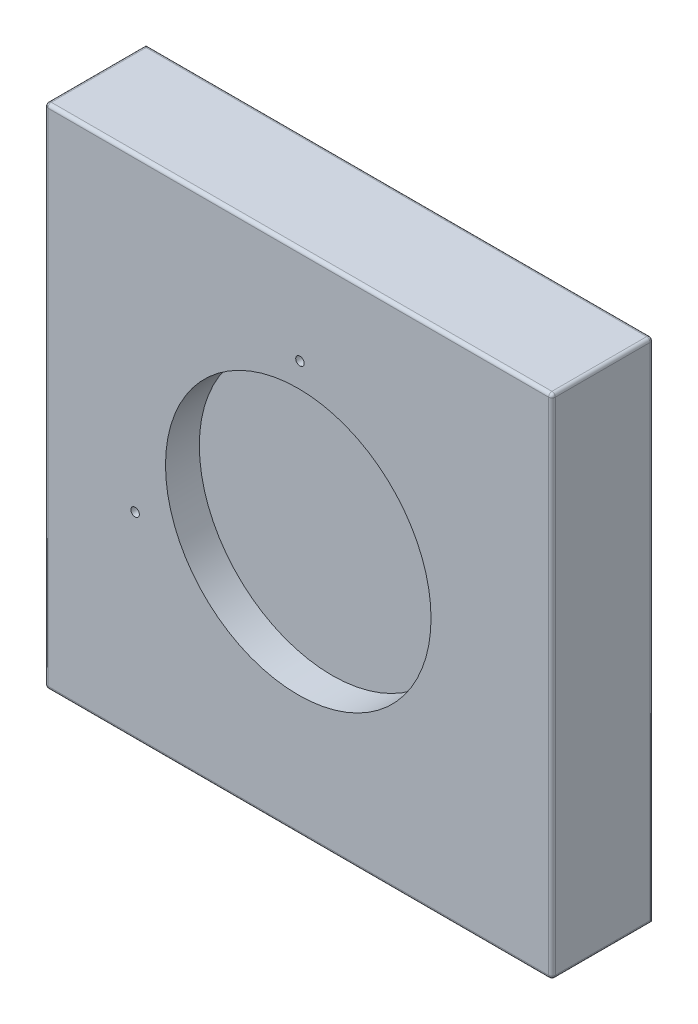
ISO-10303-21;
HEADER;
FILE_DESCRIPTION(('STEP AP214'),'2;1');
FILE_NAME('part.step','',(''),(''),'','','');
FILE_SCHEMA(('AUTOMOTIVE_DESIGN { 1 0 10303 214 1 1 1 1 }'));
ENDSEC;
DATA;
#1=APPLICATION_CONTEXT('core data for automotive mechanical design processes');
#2=APPLICATION_PROTOCOL_DEFINITION('international standard','automotive_design',2000,#1);
#3=PRODUCT_CONTEXT('',#1,'mechanical');
#4=PRODUCT('Part','Part','',(#3));
#5=PRODUCT_RELATED_PRODUCT_CATEGORY('part','',(#4));
#6=PRODUCT_DEFINITION_FORMATION('','',#4);
#7=PRODUCT_DEFINITION_CONTEXT('part definition',#1,'design');
#8=PRODUCT_DEFINITION('design','',#6,#7);
#9=PRODUCT_DEFINITION_SHAPE('','',#8);
#10=(LENGTH_UNIT() NAMED_UNIT(*) SI_UNIT(.MILLI.,.METRE.));
#11=(NAMED_UNIT(*) PLANE_ANGLE_UNIT() SI_UNIT($,.RADIAN.));
#12=(NAMED_UNIT(*) SI_UNIT($,.STERADIAN.) SOLID_ANGLE_UNIT());
#13=UNCERTAINTY_MEASURE_WITH_UNIT(LENGTH_MEASURE(1.E-05),#10,'distance_accuracy_value','');
#14=(GEOMETRIC_REPRESENTATION_CONTEXT(3) GLOBAL_UNCERTAINTY_ASSIGNED_CONTEXT((#13)) GLOBAL_UNIT_ASSIGNED_CONTEXT((#10,
#11,#12)) REPRESENTATION_CONTEXT('',''));
#15=CARTESIAN_POINT('',(0.,0.,0.));
#16=DIRECTION('',(0.,0.,1.));
#17=DIRECTION('',(1.,0.,0.));
#18=AXIS2_PLACEMENT_3D('',#15,#16,#17);
#19=CARTESIAN_POINT('',(-75.,-75.,-30.));
#20=DIRECTION('',(0.,-1.,0.));
#21=DIRECTION('',(0.,0.,-1.));
#22=AXIS2_PLACEMENT_3D('',#19,#20,#21);
#23=PLANE('',#22);
#24=DIRECTION('',(1.,0.,0.));
#25=VECTOR('',#24,1.);
#26=CARTESIAN_POINT('',(-75.,-75.,-30.));
#27=LINE('',#26,#25);
#28=CARTESIAN_POINT('',(-74.,-75.,-30.));
#29=VERTEX_POINT('',#28);
#30=CARTESIAN_POINT('',(74.,-75.,-30.));
#31=VERTEX_POINT('',#30);
#32=EDGE_CURVE('E153',#29,#31,#27,.T.);
#33=ORIENTED_EDGE('',*,*,#32,.T.);
#34=DIRECTION('',(0.,0.,1.));
#35=VECTOR('',#34,1.);
#36=CARTESIAN_POINT('',(74.,-75.,-30.));
#37=LINE('',#36,#35);
#38=CARTESIAN_POINT('',(74.,-75.,-1.));
#39=VERTEX_POINT('',#38);
#40=EDGE_CURVE('E163',#31,#39,#37,.T.);
#41=ORIENTED_EDGE('',*,*,#40,.T.);
#42=DIRECTION('',(1.,0.,0.));
#43=VECTOR('',#42,1.);
#44=CARTESIAN_POINT('',(-75.,-75.,-1.));
#45=LINE('',#44,#43);
#46=CARTESIAN_POINT('',(-74.,-75.,-1.));
#47=VERTEX_POINT('',#46);
#48=EDGE_CURVE('E159',#39,#47,#45,.F.);
#49=ORIENTED_EDGE('',*,*,#48,.T.);
#50=DIRECTION('',(0.,0.,1.));
#51=VECTOR('',#50,1.);
#52=CARTESIAN_POINT('',(-74.,-75.,-30.));
#53=LINE('',#52,#51);
#54=EDGE_CURVE('E161',#47,#29,#53,.F.);
#55=ORIENTED_EDGE('',*,*,#54,.T.);
#56=EDGE_LOOP('',(#33,#41,#49,#55));
#57=FACE_BOUND('',#56,.T.);
#58=ADVANCED_FACE('F38',(#57),#23,.T.);
#59=CARTESIAN_POINT('',(-75.,-75.,-30.));
#60=DIRECTION('',(1.,0.,0.));
#61=DIRECTION('',(0.,0.,-1.));
#62=AXIS2_PLACEMENT_3D('',#59,#60,#61);
#63=PLANE('',#62);
#64=DIRECTION('',(0.,1.,0.));
#65=VECTOR('',#64,1.);
#66=CARTESIAN_POINT('',(-75.,-75.,-30.));
#67=LINE('',#66,#65);
#68=CARTESIAN_POINT('',(-75.,-74.,-30.));
#69=VERTEX_POINT('',#68);
#70=CARTESIAN_POINT('',(-75.,74.,-30.));
#71=VERTEX_POINT('',#70);
#72=EDGE_CURVE('E156',#69,#71,#67,.T.);
#73=ORIENTED_EDGE('',*,*,#72,.F.);
#74=DIRECTION('',(0.,0.,1.));
#75=VECTOR('',#74,1.);
#76=CARTESIAN_POINT('',(-75.,-74.,0.));
#77=LINE('',#76,#75);
#78=CARTESIAN_POINT('',(-75.,-74.,-1.));
#79=VERTEX_POINT('',#78);
#80=EDGE_CURVE('E179',#69,#79,#77,.T.);
#81=ORIENTED_EDGE('',*,*,#80,.T.);
#82=DIRECTION('',(0.,1.,0.));
#83=VECTOR('',#82,1.);
#84=CARTESIAN_POINT('',(-75.,75.,-1.));
#85=LINE('',#84,#83);
#86=CARTESIAN_POINT('',(-75.,74.,-1.));
#87=VERTEX_POINT('',#86);
#88=EDGE_CURVE('E175',#79,#87,#85,.T.);
#89=ORIENTED_EDGE('',*,*,#88,.T.);
#90=DIRECTION('',(0.,0.,1.));
#91=VECTOR('',#90,1.);
#92=CARTESIAN_POINT('',(-75.,74.,-30.));
#93=LINE('',#92,#91);
#94=EDGE_CURVE('E177',#87,#71,#93,.F.);
#95=ORIENTED_EDGE('',*,*,#94,.T.);
#96=EDGE_LOOP('',(#73,#81,#89,#95));
#97=FACE_BOUND('',#96,.T.);
#98=ADVANCED_FACE('F320',(#97),#63,.F.);
#99=CARTESIAN_POINT('',(-75.,75.,-30.));
#100=DIRECTION('',(0.,-1.,0.));
#101=DIRECTION('',(0.,0.,-1.));
#102=AXIS2_PLACEMENT_3D('',#99,#100,#101);
#103=PLANE('',#102);
#104=DIRECTION('',(1.,0.,0.));
#105=VECTOR('',#104,1.);
#106=CARTESIAN_POINT('',(-75.,75.,-29.));
#107=LINE('',#106,#105);
#108=CARTESIAN_POINT('',(74.,75.,-29.));
#109=VERTEX_POINT('',#108);
#110=CARTESIAN_POINT('',(-74.,75.,-29.));
#111=VERTEX_POINT('',#110);
#112=EDGE_CURVE('E191',#109,#111,#107,.F.);
#113=ORIENTED_EDGE('',*,*,#112,.T.);
#114=DIRECTION('',(0.,0.,1.));
#115=VECTOR('',#114,1.);
#116=CARTESIAN_POINT('',(-74.,75.,-30.));
#117=LINE('',#116,#115);
#118=CARTESIAN_POINT('',(-74.,75.,-1.));
#119=VERTEX_POINT('',#118);
#120=EDGE_CURVE('E193',#111,#119,#117,.T.);
#121=ORIENTED_EDGE('',*,*,#120,.T.);
#122=DIRECTION('',(1.,0.,0.));
#123=VECTOR('',#122,1.);
#124=CARTESIAN_POINT('',(75.,75.,-1.));
#125=LINE('',#124,#123);
#126=CARTESIAN_POINT('',(74.,75.,-1.));
#127=VERTEX_POINT('',#126);
#128=EDGE_CURVE('E187',#119,#127,#125,.T.);
#129=ORIENTED_EDGE('',*,*,#128,.T.);
#130=DIRECTION('',(0.,0.,1.));
#131=VECTOR('',#130,1.);
#132=CARTESIAN_POINT('',(74.,75.,-30.));
#133=LINE('',#132,#131);
#134=EDGE_CURVE('E189',#127,#109,#133,.F.);
#135=ORIENTED_EDGE('',*,*,#134,.T.);
#136=EDGE_LOOP('',(#113,#121,#129,#135));
#137=FACE_BOUND('',#136,.T.);
#138=ADVANCED_FACE('F254',(#137),#103,.F.);
#139=CARTESIAN_POINT('',(75.,-75.,-30.));
#140=DIRECTION('',(1.,0.,0.));
#141=DIRECTION('',(0.,0.,-1.));
#142=AXIS2_PLACEMENT_3D('',#139,#140,#141);
#143=PLANE('',#142);
#144=DIRECTION('',(0.,1.,0.));
#145=VECTOR('',#144,1.);
#146=CARTESIAN_POINT('',(75.,-75.,-1.));
#147=LINE('',#146,#145);
#148=CARTESIAN_POINT('',(75.,74.,-1.));
#149=VERTEX_POINT('',#148);
#150=CARTESIAN_POINT('',(75.,-74.,-1.));
#151=VERTEX_POINT('',#150);
#152=EDGE_CURVE('E166',#149,#151,#147,.F.);
#153=ORIENTED_EDGE('',*,*,#152,.T.);
#154=DIRECTION('',(0.,0.,1.));
#155=VECTOR('',#154,1.);
#156=CARTESIAN_POINT('',(75.,-74.,-30.));
#157=LINE('',#156,#155);
#158=CARTESIAN_POINT('',(75.,-74.,-29.));
#159=VERTEX_POINT('',#158);
#160=EDGE_CURVE('E172',#151,#159,#157,.F.);
#161=ORIENTED_EDGE('',*,*,#160,.T.);
#162=DIRECTION('',(0.,1.,0.));
#163=VECTOR('',#162,1.);
#164=CARTESIAN_POINT('',(75.,75.,-29.));
#165=LINE('',#164,#163);
#166=CARTESIAN_POINT('',(75.,74.,-29.));
#167=VERTEX_POINT('',#166);
#168=EDGE_CURVE('E170',#159,#167,#165,.T.);
#169=ORIENTED_EDGE('',*,*,#168,.T.);
#170=DIRECTION('',(0.,0.,1.));
#171=VECTOR('',#170,1.);
#172=CARTESIAN_POINT('',(75.,74.,0.));
#173=LINE('',#172,#171);
#174=EDGE_CURVE('E168',#167,#149,#173,.T.);
#175=ORIENTED_EDGE('',*,*,#174,.T.);
#176=EDGE_LOOP('',(#153,#161,#169,#175));
#177=FACE_BOUND('',#176,.T.);
#178=ADVANCED_FACE('F306',(#177),#143,.T.);
#179=CARTESIAN_POINT('',(0.,0.,-30.));
#180=DIRECTION('',(0.,0.,1.));
#181=DIRECTION('',(1.,0.,0.));
#182=AXIS2_PLACEMENT_3D('',#179,#180,#181);
#183=PLANE('',#182);
#184=ORIENTED_EDGE('',*,*,#32,.F.);
#185=CARTESIAN_POINT('',(-74.,-74.,-30.));
#186=DIRECTION('',(0.,0.,1.));
#187=DIRECTION('',(1.,0.,0.));
#188=AXIS2_PLACEMENT_3D('',#185,#186,#187);
#189=CIRCLE('',#188,1.);
#190=EDGE_CURVE('E185',#29,#69,#189,.F.);
#191=ORIENTED_EDGE('',*,*,#190,.T.);
#192=ORIENTED_EDGE('',*,*,#72,.T.);
#193=DIRECTION('',(1.,0.,0.));
#194=VECTOR('',#193,1.);
#195=CARTESIAN_POINT('',(0.,74.,-30.));
#196=LINE('',#195,#194);
#197=CARTESIAN_POINT('',(74.,74.,-30.));
#198=VERTEX_POINT('',#197);
#199=EDGE_CURVE('E181',#71,#198,#196,.T.);
#200=ORIENTED_EDGE('',*,*,#199,.T.);
#201=DIRECTION('',(0.,1.,0.));
#202=VECTOR('',#201,1.);
#203=CARTESIAN_POINT('',(74.,-75.,-30.));
#204=LINE('',#203,#202);
#205=EDGE_CURVE('E183',#198,#31,#204,.F.);
#206=ORIENTED_EDGE('',*,*,#205,.T.);
#207=EDGE_LOOP('',(#184,#191,#192,#200,#206));
#208=FACE_BOUND('',#207,.T.);
#209=ADVANCED_FACE('F278',(#208),#183,.F.);
#210=CARTESIAN_POINT('',(0.,0.,0.));
#211=DIRECTION('',(0.,0.,1.));
#212=DIRECTION('',(1.,0.,0.));
#213=AXIS2_PLACEMENT_3D('',#210,#211,#212);
#214=PLANE('',#213);
#215=CARTESIAN_POINT('',(0.496213053365321,46.5,0.));
#216=DIRECTION('',(0.,0.,1.));
#217=DIRECTION('',(1.,0.,0.));
#218=AXIS2_PLACEMENT_3D('',#215,#216,#217);
#219=CIRCLE('',#218,1.24999999999999);
#220=CARTESIAN_POINT('',(1.74621305336531,46.5,0.));
#221=VERTEX_POINT('',#220);
#222=EDGE_CURVE('E136',#221,#221,#219,.T.);
#223=ORIENTED_EDGE('',*,*,#222,.F.);
#224=EDGE_LOOP('',(#223));
#225=FACE_BOUND('',#224,.T.);
#226=CARTESIAN_POINT('',(-48.2375471335506,-16.5472529741879,0.));
#227=DIRECTION('',(0.,0.,1.));
#228=DIRECTION('',(1.,0.,0.));
#229=AXIS2_PLACEMENT_3D('',#226,#227,#228);
#230=CIRCLE('',#229,1.24999999999999);
#231=CARTESIAN_POINT('',(-46.9875471335506,-16.5472529741879,0.));
#232=VERTEX_POINT('',#231);
#233=EDGE_CURVE('E135',#232,#232,#230,.T.);
#234=ORIENTED_EDGE('',*,*,#233,.F.);
#235=EDGE_LOOP('',(#234));
#236=FACE_BOUND('',#235,.T.);
#237=CARTESIAN_POINT('',(0.,0.,0.));
#238=DIRECTION('',(0.,0.,1.));
#239=DIRECTION('',(1.,0.,0.));
#240=AXIS2_PLACEMENT_3D('',#237,#238,#239);
#241=CIRCLE('',#240,39.25);
#242=CARTESIAN_POINT('',(39.25,0.,0.));
#243=VERTEX_POINT('',#242);
#244=EDGE_CURVE('E146',#243,#243,#241,.T.);
#245=ORIENTED_EDGE('',*,*,#244,.F.);
#246=EDGE_LOOP('',(#245));
#247=FACE_BOUND('',#246,.T.);
#248=DIRECTION('',(0.,1.,0.));
#249=VECTOR('',#248,1.);
#250=CARTESIAN_POINT('',(-74.,-75.,0.));
#251=LINE('',#250,#249);
#252=CARTESIAN_POINT('',(-74.,74.,0.));
#253=VERTEX_POINT('',#252);
#254=CARTESIAN_POINT('',(-74.,-74.,0.));
#255=VERTEX_POINT('',#254);
#256=EDGE_CURVE('E47',#253,#255,#251,.F.);
#257=ORIENTED_EDGE('',*,*,#256,.T.);
#258=DIRECTION('',(1.,0.,0.));
#259=VECTOR('',#258,1.);
#260=CARTESIAN_POINT('',(0.,-74.,0.));
#261=LINE('',#260,#259);
#262=CARTESIAN_POINT('',(74.,-74.,0.));
#263=VERTEX_POINT('',#262);
#264=EDGE_CURVE('E11',#255,#263,#261,.T.);
#265=ORIENTED_EDGE('',*,*,#264,.T.);
#266=DIRECTION('',(0.,1.,0.));
#267=VECTOR('',#266,1.);
#268=CARTESIAN_POINT('',(74.,0.,0.));
#269=LINE('',#268,#267);
#270=CARTESIAN_POINT('',(74.,74.,0.));
#271=VERTEX_POINT('',#270);
#272=EDGE_CURVE('E198',#263,#271,#269,.T.);
#273=ORIENTED_EDGE('',*,*,#272,.T.);
#274=DIRECTION('',(1.,0.,0.));
#275=VECTOR('',#274,1.);
#276=CARTESIAN_POINT('',(-75.,74.,0.));
#277=LINE('',#276,#275);
#278=EDGE_CURVE('E196',#271,#253,#277,.F.);
#279=ORIENTED_EDGE('',*,*,#278,.T.);
#280=EDGE_LOOP('',(#257,#265,#273,#279));
#281=FACE_BOUND('',#280,.T.);
#282=ADVANCED_FACE('F294',(#225,#236,#247,#281),#214,.T.);
#283=CARTESIAN_POINT('',(-74.,74.,-1.));
#284=DIRECTION('',(-1.,0.,0.));
#285=DIRECTION('',(0.,0.,1.));
#286=AXIS2_PLACEMENT_3D('',#283,#284,#285);
#287=SPHERICAL_SURFACE('',#286,1.);
#288=CARTESIAN_POINT('',(-74.,74.,-1.));
#289=DIRECTION('',(-1.,0.,0.));
#290=DIRECTION('',(0.,0.,1.));
#291=AXIS2_PLACEMENT_3D('',#288,#289,#290);
#292=CIRCLE('',#291,1.);
#293=EDGE_CURVE('E237',#119,#253,#292,.F.);
#294=ORIENTED_EDGE('',*,*,#293,.F.);
#295=CARTESIAN_POINT('',(-74.,74.,-1.));
#296=DIRECTION('',(0.,0.,1.));
#297=DIRECTION('',(1.,0.,0.));
#298=AXIS2_PLACEMENT_3D('',#295,#296,#297);
#299=CIRCLE('',#298,1.);
#300=EDGE_CURVE('E42',#87,#119,#299,.F.);
#301=ORIENTED_EDGE('',*,*,#300,.F.);
#302=CARTESIAN_POINT('',(-74.,74.,-1.));
#303=DIRECTION('',(0.,1.,0.));
#304=DIRECTION('',(0.,0.,1.));
#305=AXIS2_PLACEMENT_3D('',#302,#303,#304);
#306=CIRCLE('',#305,1.);
#307=EDGE_CURVE('E239',#253,#87,#306,.F.);
#308=ORIENTED_EDGE('',*,*,#307,.F.);
#309=EDGE_LOOP('',(#294,#301,#308));
#310=FACE_BOUND('',#309,.T.);
#311=ADVANCED_FACE('F40',(#310),#287,.T.);
#312=CARTESIAN_POINT('',(-74.,74.,-30.));
#313=DIRECTION('',(0.,0.,1.));
#314=DIRECTION('',(1.,0.,0.));
#315=AXIS2_PLACEMENT_3D('',#312,#313,#314);
#316=CYLINDRICAL_SURFACE('',#315,1.);
#317=ORIENTED_EDGE('',*,*,#300,.T.);
#318=ORIENTED_EDGE('',*,*,#120,.F.);
#319=CARTESIAN_POINT('',(-74.,74.,-29.));
#320=DIRECTION('',(0.707106781186547,0.,-0.707106781186547));
#321=DIRECTION('',(0.707106781186547,0.,0.707106781186547));
#322=AXIS2_PLACEMENT_3D('',#319,#320,#321);
#323=ELLIPSE('',#322,1.41421356237309,1.);
#324=EDGE_CURVE('E234',#71,#111,#323,.T.);
#325=ORIENTED_EDGE('',*,*,#324,.F.);
#326=ORIENTED_EDGE('',*,*,#94,.F.);
#327=EDGE_LOOP('',(#317,#318,#325,#326));
#328=FACE_BOUND('',#327,.T.);
#329=ADVANCED_FACE('F249',(#328),#316,.T.);
#330=CARTESIAN_POINT('',(-74.,-74.,-30.));
#331=DIRECTION('',(0.,0.,-1.));
#332=DIRECTION('',(-1.,0.,0.));
#333=AXIS2_PLACEMENT_3D('',#330,#331,#332);
#334=CYLINDRICAL_SURFACE('',#333,1.);
#335=ORIENTED_EDGE('',*,*,#190,.F.);
#336=ORIENTED_EDGE('',*,*,#54,.F.);
#337=CARTESIAN_POINT('',(-74.,-74.,-1.));
#338=DIRECTION('',(0.,0.,1.));
#339=DIRECTION('',(0.,-1.,0.));
#340=AXIS2_PLACEMENT_3D('',#337,#338,#339);
#341=CIRCLE('',#340,1.);
#342=EDGE_CURVE('E231',#79,#47,#341,.T.);
#343=ORIENTED_EDGE('',*,*,#342,.F.);
#344=ORIENTED_EDGE('',*,*,#80,.F.);
#345=EDGE_LOOP('',(#335,#336,#343,#344));
#346=FACE_BOUND('',#345,.T.);
#347=ADVANCED_FACE('F285',(#346),#334,.T.);
#348=CARTESIAN_POINT('',(-74.,-75.,-1.));
#349=DIRECTION('',(0.,-1.,0.));
#350=DIRECTION('',(0.,0.,-1.));
#351=AXIS2_PLACEMENT_3D('',#348,#349,#350);
#352=CYLINDRICAL_SURFACE('',#351,1.);
#353=ORIENTED_EDGE('',*,*,#307,.T.);
#354=ORIENTED_EDGE('',*,*,#88,.F.);
#355=CARTESIAN_POINT('',(-74.,-74.,-1.));
#356=DIRECTION('',(0.,-1.,0.));
#357=DIRECTION('',(0.,0.,-1.));
#358=AXIS2_PLACEMENT_3D('',#355,#356,#357);
#359=CIRCLE('',#358,1.);
#360=EDGE_CURVE('E228',#255,#79,#359,.T.);
#361=ORIENTED_EDGE('',*,*,#360,.F.);
#362=ORIENTED_EDGE('',*,*,#256,.F.);
#363=EDGE_LOOP('',(#353,#354,#361,#362));
#364=FACE_BOUND('',#363,.T.);
#365=ADVANCED_FACE('F462',(#364),#352,.T.);
#366=CARTESIAN_POINT('',(-75.,74.,-1.));
#367=DIRECTION('',(-1.,0.,0.));
#368=DIRECTION('',(0.,0.,1.));
#369=AXIS2_PLACEMENT_3D('',#366,#367,#368);
#370=CYLINDRICAL_SURFACE('',#369,1.);
#371=ORIENTED_EDGE('',*,*,#293,.T.);
#372=ORIENTED_EDGE('',*,*,#278,.F.);
#373=CARTESIAN_POINT('',(74.,74.,-1.));
#374=DIRECTION('',(1.,0.,0.));
#375=DIRECTION('',(0.,0.,-1.));
#376=AXIS2_PLACEMENT_3D('',#373,#374,#375);
#377=CIRCLE('',#376,1.);
#378=EDGE_CURVE('E225',#127,#271,#377,.T.);
#379=ORIENTED_EDGE('',*,*,#378,.F.);
#380=ORIENTED_EDGE('',*,*,#128,.F.);
#381=EDGE_LOOP('',(#371,#372,#379,#380));
#382=FACE_BOUND('',#381,.T.);
#383=ADVANCED_FACE('F298',(#382),#370,.T.);
#384=CARTESIAN_POINT('',(74.,74.,-30.));
#385=DIRECTION('',(0.,0.,-1.));
#386=DIRECTION('',(-1.,0.,0.));
#387=AXIS2_PLACEMENT_3D('',#384,#385,#386);
#388=CYLINDRICAL_SURFACE('',#387,1.);
#389=CARTESIAN_POINT('',(74.,74.,-29.));
#390=DIRECTION('',(0.,0.,-1.));
#391=DIRECTION('',(-1.,0.,0.));
#392=AXIS2_PLACEMENT_3D('',#389,#390,#391);
#393=CIRCLE('',#392,1.);
#394=EDGE_CURVE('E219',#109,#167,#393,.T.);
#395=ORIENTED_EDGE('',*,*,#394,.F.);
#396=ORIENTED_EDGE('',*,*,#134,.F.);
#397=CARTESIAN_POINT('',(74.,74.,-1.));
#398=DIRECTION('',(0.,0.,1.));
#399=DIRECTION('',(0.,-1.,0.));
#400=AXIS2_PLACEMENT_3D('',#397,#398,#399);
#401=CIRCLE('',#400,1.);
#402=EDGE_CURVE('E222',#149,#127,#401,.T.);
#403=ORIENTED_EDGE('',*,*,#402,.F.);
#404=ORIENTED_EDGE('',*,*,#174,.F.);
#405=EDGE_LOOP('',(#395,#396,#403,#404));
#406=FACE_BOUND('',#405,.T.);
#407=ADVANCED_FACE('F265',(#406),#388,.T.);
#408=CARTESIAN_POINT('',(0.,74.,-29.));
#409=DIRECTION('',(1.,0.,0.));
#410=DIRECTION('',(0.,0.,-1.));
#411=AXIS2_PLACEMENT_3D('',#408,#409,#410);
#412=CYLINDRICAL_SURFACE('',#411,1.);
#413=ORIENTED_EDGE('',*,*,#324,.T.);
#414=ORIENTED_EDGE('',*,*,#112,.F.);
#415=CARTESIAN_POINT('',(74.,74.,-29.));
#416=DIRECTION('',(1.,0.,0.));
#417=DIRECTION('',(0.,0.,-1.));
#418=AXIS2_PLACEMENT_3D('',#415,#416,#417);
#419=CIRCLE('',#418,1.);
#420=EDGE_CURVE('E216',#198,#109,#419,.T.);
#421=ORIENTED_EDGE('',*,*,#420,.F.);
#422=ORIENTED_EDGE('',*,*,#199,.F.);
#423=EDGE_LOOP('',(#413,#414,#421,#422));
#424=FACE_BOUND('',#423,.T.);
#425=ADVANCED_FACE('F260',(#424),#412,.T.);
#426=CARTESIAN_POINT('',(-74.,-74.,-1.));
#427=DIRECTION('',(-1.,0.,0.));
#428=DIRECTION('',(0.,0.,1.));
#429=AXIS2_PLACEMENT_3D('',#426,#427,#428);
#430=SPHERICAL_SURFACE('',#429,1.);
#431=ORIENTED_EDGE('',*,*,#360,.T.);
#432=ORIENTED_EDGE('',*,*,#342,.T.);
#433=CARTESIAN_POINT('',(-74.,-74.,-1.));
#434=DIRECTION('',(-1.,0.,0.));
#435=DIRECTION('',(0.,0.,1.));
#436=AXIS2_PLACEMENT_3D('',#433,#434,#435);
#437=CIRCLE('',#436,1.);
#438=EDGE_CURVE('E213',#255,#47,#437,.F.);
#439=ORIENTED_EDGE('',*,*,#438,.F.);
#440=EDGE_LOOP('',(#431,#432,#439));
#441=FACE_BOUND('',#440,.T.);
#442=ADVANCED_FACE('F289',(#441),#430,.T.);
#443=CARTESIAN_POINT('',(74.,74.,-1.));
#444=DIRECTION('',(0.,1.,0.));
#445=DIRECTION('',(0.,0.,1.));
#446=AXIS2_PLACEMENT_3D('',#443,#444,#445);
#447=SPHERICAL_SURFACE('',#446,1.);
#448=ORIENTED_EDGE('',*,*,#402,.T.);
#449=ORIENTED_EDGE('',*,*,#378,.T.);
#450=CARTESIAN_POINT('',(74.,74.,-1.));
#451=DIRECTION('',(0.,1.,0.));
#452=DIRECTION('',(0.,0.,1.));
#453=AXIS2_PLACEMENT_3D('',#450,#451,#452);
#454=CIRCLE('',#453,1.);
#455=EDGE_CURVE('E210',#149,#271,#454,.F.);
#456=ORIENTED_EDGE('',*,*,#455,.F.);
#457=EDGE_LOOP('',(#448,#449,#456));
#458=FACE_BOUND('',#457,.T.);
#459=ADVANCED_FACE('F301',(#458),#447,.T.);
#460=CARTESIAN_POINT('',(74.,74.,-29.));
#461=DIRECTION('',(0.,1.,0.));
#462=DIRECTION('',(0.,0.,1.));
#463=AXIS2_PLACEMENT_3D('',#460,#461,#462);
#464=SPHERICAL_SURFACE('',#463,1.);
#465=ORIENTED_EDGE('',*,*,#420,.T.);
#466=ORIENTED_EDGE('',*,*,#394,.T.);
#467=CARTESIAN_POINT('',(74.,74.,-29.));
#468=DIRECTION('',(0.,1.,0.));
#469=DIRECTION('',(0.,0.,1.));
#470=AXIS2_PLACEMENT_3D('',#467,#468,#469);
#471=CIRCLE('',#470,1.);
#472=EDGE_CURVE('E207',#198,#167,#471,.F.);
#473=ORIENTED_EDGE('',*,*,#472,.F.);
#474=EDGE_LOOP('',(#465,#466,#473));
#475=FACE_BOUND('',#474,.T.);
#476=ADVANCED_FACE('F269',(#475),#464,.T.);
#477=CARTESIAN_POINT('',(0.,-74.,-1.));
#478=DIRECTION('',(1.,0.,0.));
#479=DIRECTION('',(0.,0.,-1.));
#480=AXIS2_PLACEMENT_3D('',#477,#478,#479);
#481=CYLINDRICAL_SURFACE('',#480,1.);
#482=ORIENTED_EDGE('',*,*,#438,.T.);
#483=ORIENTED_EDGE('',*,*,#48,.F.);
#484=CARTESIAN_POINT('',(74.,-74.,-1.));
#485=DIRECTION('',(1.,0.,0.));
#486=DIRECTION('',(0.,0.,-1.));
#487=AXIS2_PLACEMENT_3D('',#484,#485,#486);
#488=CIRCLE('',#487,1.);
#489=EDGE_CURVE('E205',#263,#39,#488,.T.);
#490=ORIENTED_EDGE('',*,*,#489,.F.);
#491=ORIENTED_EDGE('',*,*,#264,.F.);
#492=EDGE_LOOP('',(#482,#483,#490,#491));
#493=FACE_BOUND('',#492,.T.);
#494=ADVANCED_FACE('F292',(#493),#481,.T.);
#495=CARTESIAN_POINT('',(74.,0.,-1.));
#496=DIRECTION('',(0.,1.,0.));
#497=DIRECTION('',(0.,0.,1.));
#498=AXIS2_PLACEMENT_3D('',#495,#496,#497);
#499=CYLINDRICAL_SURFACE('',#498,1.);
#500=ORIENTED_EDGE('',*,*,#455,.T.);
#501=ORIENTED_EDGE('',*,*,#272,.F.);
#502=CARTESIAN_POINT('',(74.,-74.,-1.));
#503=DIRECTION('',(0.,-1.,0.));
#504=DIRECTION('',(0.,0.,-1.));
#505=AXIS2_PLACEMENT_3D('',#502,#503,#504);
#506=CIRCLE('',#505,1.);
#507=EDGE_CURVE('E61',#151,#263,#506,.T.);
#508=ORIENTED_EDGE('',*,*,#507,.F.);
#509=ORIENTED_EDGE('',*,*,#152,.F.);
#510=EDGE_LOOP('',(#500,#501,#508,#509));
#511=FACE_BOUND('',#510,.T.);
#512=ADVANCED_FACE('F303',(#511),#499,.T.);
#513=CARTESIAN_POINT('',(74.,-75.,-29.));
#514=DIRECTION('',(0.,-1.,0.));
#515=DIRECTION('',(0.,0.,-1.));
#516=AXIS2_PLACEMENT_3D('',#513,#514,#515);
#517=CYLINDRICAL_SURFACE('',#516,1.);
#518=ORIENTED_EDGE('',*,*,#472,.T.);
#519=ORIENTED_EDGE('',*,*,#168,.F.);
#520=CARTESIAN_POINT('',(74.,-74.,-29.));
#521=DIRECTION('',(0.,-0.707106781186547,0.707106781186547));
#522=DIRECTION('',(0.,-0.707106781186547,-0.707106781186547));
#523=AXIS2_PLACEMENT_3D('',#520,#521,#522);
#524=ELLIPSE('',#523,1.41421356237309,1.);
#525=EDGE_CURVE('E202',#31,#159,#524,.T.);
#526=ORIENTED_EDGE('',*,*,#525,.F.);
#527=ORIENTED_EDGE('',*,*,#205,.F.);
#528=EDGE_LOOP('',(#518,#519,#526,#527));
#529=FACE_BOUND('',#528,.T.);
#530=ADVANCED_FACE('F274',(#529),#517,.T.);
#531=CARTESIAN_POINT('',(74.,-74.,-1.));
#532=DIRECTION('',(0.,0.,1.));
#533=DIRECTION('',(1.,0.,0.));
#534=AXIS2_PLACEMENT_3D('',#531,#532,#533);
#535=SPHERICAL_SURFACE('',#534,1.);
#536=ORIENTED_EDGE('',*,*,#507,.T.);
#537=ORIENTED_EDGE('',*,*,#489,.T.);
#538=CARTESIAN_POINT('',(74.,-74.,-1.));
#539=DIRECTION('',(0.,0.,1.));
#540=DIRECTION('',(1.,0.,0.));
#541=AXIS2_PLACEMENT_3D('',#538,#539,#540);
#542=CIRCLE('',#541,1.);
#543=EDGE_CURVE('E150',#151,#39,#542,.F.);
#544=ORIENTED_EDGE('',*,*,#543,.F.);
#545=EDGE_LOOP('',(#536,#537,#544));
#546=FACE_BOUND('',#545,.T.);
#547=ADVANCED_FACE('F309',(#546),#535,.T.);
#548=CARTESIAN_POINT('',(74.,-74.,-30.));
#549=DIRECTION('',(0.,0.,1.));
#550=DIRECTION('',(1.,0.,0.));
#551=AXIS2_PLACEMENT_3D('',#548,#549,#550);
#552=CYLINDRICAL_SURFACE('',#551,1.);
#553=ORIENTED_EDGE('',*,*,#525,.T.);
#554=ORIENTED_EDGE('',*,*,#160,.F.);
#555=ORIENTED_EDGE('',*,*,#543,.T.);
#556=ORIENTED_EDGE('',*,*,#40,.F.);
#557=EDGE_LOOP('',(#553,#554,#555,#556));
#558=FACE_BOUND('',#557,.T.);
#559=ADVANCED_FACE('F308',(#558),#552,.T.);
#560=CARTESIAN_POINT('',(0.,0.,-10.));
#561=DIRECTION('',(0.,0.,1.));
#562=DIRECTION('',(1.,0.,0.));
#563=AXIS2_PLACEMENT_3D('',#560,#561,#562);
#564=CYLINDRICAL_SURFACE('',#563,39.25);
#565=CARTESIAN_POINT('',(0.,0.,-10.));
#566=DIRECTION('',(0.,0.,1.));
#567=DIRECTION('',(1.,0.,0.));
#568=AXIS2_PLACEMENT_3D('',#565,#566,#567);
#569=CIRCLE('',#568,39.25);
#570=CARTESIAN_POINT('',(39.25,0.,-10.));
#571=VERTEX_POINT('',#570);
#572=EDGE_CURVE('E147',#571,#571,#569,.T.);
#573=ORIENTED_EDGE('',*,*,#572,.F.);
#574=EDGE_LOOP('',(#573));
#575=FACE_BOUND('',#574,.T.);
#576=ORIENTED_EDGE('',*,*,#244,.T.);
#577=EDGE_LOOP('',(#576));
#578=FACE_BOUND('',#577,.T.);
#579=ADVANCED_FACE('F316',(#575,#578),#564,.F.);
#580=CARTESIAN_POINT('',(0.,0.,-10.));
#581=DIRECTION('',(0.,0.,1.));
#582=DIRECTION('',(1.,0.,0.));
#583=AXIS2_PLACEMENT_3D('',#580,#581,#582);
#584=PLANE('',#583);
#585=ORIENTED_EDGE('',*,*,#572,.T.);
#586=EDGE_LOOP('',(#585));
#587=FACE_BOUND('',#586,.T.);
#588=ADVANCED_FACE('F339',(#587),#584,.T.);
#589=CARTESIAN_POINT('',(-48.2375471335506,-16.5472529741879,-10.));
#590=DIRECTION('',(0.,0.,1.));
#591=DIRECTION('',(1.,0.,0.));
#592=AXIS2_PLACEMENT_3D('',#589,#590,#591);
#593=CONICAL_SURFACE('',#592,1.24999999999999,1.02974425867665);
#594=CARTESIAN_POINT('',(-48.2375471335506,-16.5472529741879,-10.7510757737845));
#595=VERTEX_POINT('',#594);
#596=VERTEX_LOOP('',#595);
#597=FACE_BOUND('',#596,.T.);
#598=CARTESIAN_POINT('',(-48.2375471335506,-16.5472529741879,-10.));
#599=DIRECTION('',(0.,0.,1.));
#600=DIRECTION('',(1.,0.,0.));
#601=AXIS2_PLACEMENT_3D('',#598,#599,#600);
#602=CIRCLE('',#601,1.24999999999999);
#603=CARTESIAN_POINT('',(-46.9875471335506,-16.5472529741879,-10.));
#604=VERTEX_POINT('',#603);
#605=EDGE_CURVE('E139',#604,#604,#602,.T.);
#606=ORIENTED_EDGE('',*,*,#605,.T.);
#607=EDGE_LOOP('',(#606));
#608=FACE_BOUND('',#607,.T.);
#609=ADVANCED_FACE('F343',(#597,#608),#593,.F.);
#610=CARTESIAN_POINT('',(-48.2375471335506,-16.5472529741879,0.));
#611=DIRECTION('',(0.,0.,1.));
#612=DIRECTION('',(1.,0.,0.));
#613=AXIS2_PLACEMENT_3D('',#610,#611,#612);
#614=CYLINDRICAL_SURFACE('',#613,1.24999999999999);
#615=ORIENTED_EDGE('',*,*,#605,.F.);
#616=EDGE_LOOP('',(#615));
#617=FACE_BOUND('',#616,.T.);
#618=ORIENTED_EDGE('',*,*,#233,.T.);
#619=EDGE_LOOP('',(#618));
#620=FACE_BOUND('',#619,.T.);
#621=ADVANCED_FACE('F129',(#617,#620),#614,.F.);
#622=CARTESIAN_POINT('',(0.496213053365321,46.5,-10.));
#623=DIRECTION('',(0.,0.,1.));
#624=DIRECTION('',(1.,0.,0.));
#625=AXIS2_PLACEMENT_3D('',#622,#623,#624);
#626=CONICAL_SURFACE('',#625,1.25,1.02974425867665);
#627=CARTESIAN_POINT('',(0.496213053365319,46.5,-10.7510757737845));
#628=VERTEX_POINT('',#627);
#629=VERTEX_LOOP('',#628);
#630=FACE_BOUND('',#629,.T.);
#631=CARTESIAN_POINT('',(0.496213053365321,46.5,-10.));
#632=DIRECTION('',(0.,0.,1.));
#633=DIRECTION('',(1.,0.,0.));
#634=AXIS2_PLACEMENT_3D('',#631,#632,#633);
#635=CIRCLE('',#634,1.25);
#636=CARTESIAN_POINT('',(1.74621305336532,46.5,-10.));
#637=VERTEX_POINT('',#636);
#638=EDGE_CURVE('E133',#637,#637,#635,.T.);
#639=ORIENTED_EDGE('',*,*,#638,.T.);
#640=EDGE_LOOP('',(#639));
#641=FACE_BOUND('',#640,.T.);
#642=ADVANCED_FACE('F125',(#630,#641),#626,.F.);
#643=CARTESIAN_POINT('',(0.496213053365321,46.5,0.));
#644=DIRECTION('',(0.,0.,1.));
#645=DIRECTION('',(1.,0.,0.));
#646=AXIS2_PLACEMENT_3D('',#643,#644,#645);
#647=CYLINDRICAL_SURFACE('',#646,1.24999999999999);
#648=ORIENTED_EDGE('',*,*,#638,.F.);
#649=EDGE_LOOP('',(#648));
#650=FACE_BOUND('',#649,.T.);
#651=ORIENTED_EDGE('',*,*,#222,.T.);
#652=EDGE_LOOP('',(#651));
#653=FACE_BOUND('',#652,.T.);
#654=ADVANCED_FACE('F128',(#650,#653),#647,.F.);
#655=CLOSED_SHELL('',(#58,#98,#138,#178,#209,#282,#311,#329,#347,#365,#383,#407,#425,#442,#459,
#476,#494,#512,#530,#547,#559,#579,#588,#609,#621,#642,#654));
#656=MANIFOLD_SOLID_BREP('B2',#655);
#657=ADVANCED_BREP_SHAPE_REPRESENTATION('',(#18,#656),#14);
#658=SHAPE_DEFINITION_REPRESENTATION(#9,#657);
ENDSEC;
END-ISO-10303-21;
